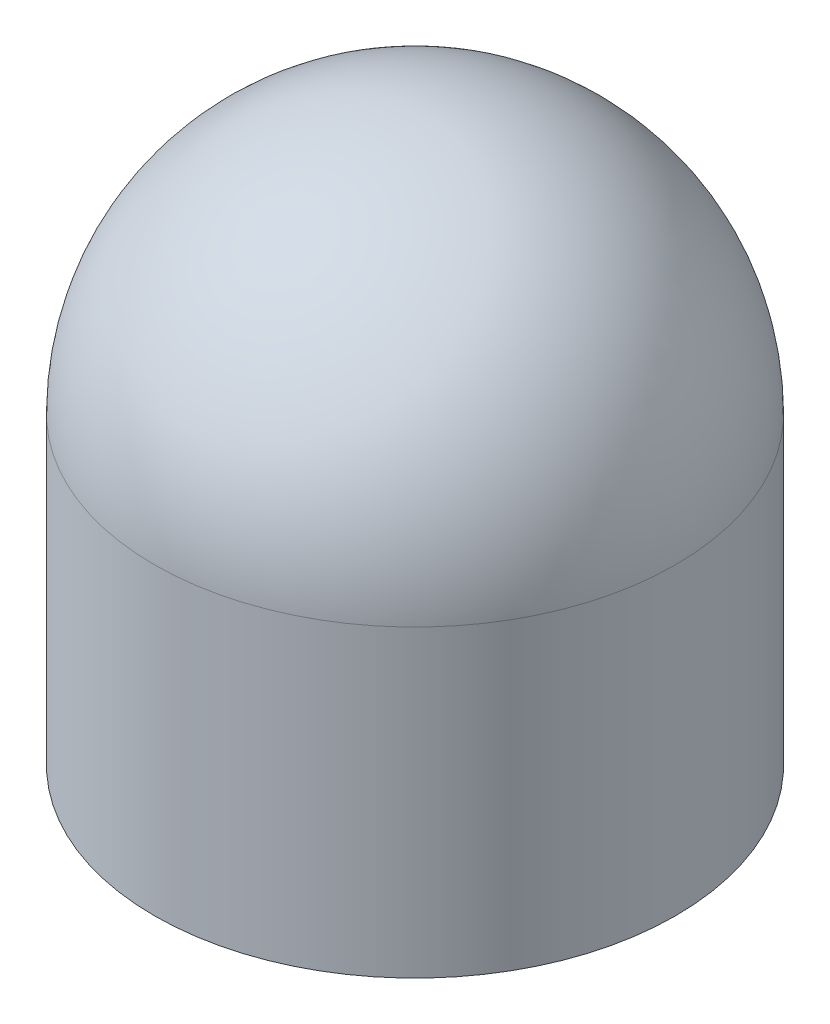
ISO-10303-21;
HEADER;
FILE_DESCRIPTION(('STEP AP214'),'2;1');
FILE_NAME('part.step','',(''),(''),'','','');
FILE_SCHEMA(('AUTOMOTIVE_DESIGN { 1 0 10303 214 1 1 1 1 }'));
ENDSEC;
DATA;
#1=APPLICATION_CONTEXT('core data for automotive mechanical design processes');
#2=APPLICATION_PROTOCOL_DEFINITION('international standard','automotive_design',2000,#1);
#3=PRODUCT_CONTEXT('',#1,'mechanical');
#4=PRODUCT('Part','Part','',(#3));
#5=PRODUCT_RELATED_PRODUCT_CATEGORY('part','',(#4));
#6=PRODUCT_DEFINITION_FORMATION('','',#4);
#7=PRODUCT_DEFINITION_CONTEXT('part definition',#1,'design');
#8=PRODUCT_DEFINITION('design','',#6,#7);
#9=PRODUCT_DEFINITION_SHAPE('','',#8);
#10=(LENGTH_UNIT() NAMED_UNIT(*) SI_UNIT(.MILLI.,.METRE.));
#11=(NAMED_UNIT(*) PLANE_ANGLE_UNIT() SI_UNIT($,.RADIAN.));
#12=(NAMED_UNIT(*) SI_UNIT($,.STERADIAN.) SOLID_ANGLE_UNIT());
#13=UNCERTAINTY_MEASURE_WITH_UNIT(LENGTH_MEASURE(1.E-05),#10,'distance_accuracy_value','');
#14=(GEOMETRIC_REPRESENTATION_CONTEXT(3) GLOBAL_UNCERTAINTY_ASSIGNED_CONTEXT((#13)) GLOBAL_UNIT_ASSIGNED_CONTEXT((#10,
#11,#12)) REPRESENTATION_CONTEXT('',''));
#15=CARTESIAN_POINT('',(0.,0.,0.));
#16=DIRECTION('',(0.,0.,1.));
#17=DIRECTION('',(1.,0.,0.));
#18=AXIS2_PLACEMENT_3D('',#15,#16,#17);
#19=CARTESIAN_POINT('',(0.,1.75,0.));
#20=DIRECTION('',(0.,-1.,0.));
#21=DIRECTION('',(0.,0.,-1.));
#22=AXIS2_PLACEMENT_3D('',#19,#20,#21);
#23=CYLINDRICAL_SURFACE('',#22,1.5);
#24=CARTESIAN_POINT('',(0.,1.75,0.));
#25=DIRECTION('',(0.,1.,0.));
#26=DIRECTION('',(0.,0.,1.));
#27=AXIS2_PLACEMENT_3D('',#24,#25,#26);
#28=CIRCLE('',#27,1.5);
#29=CARTESIAN_POINT('',(0.,1.75,1.5));
#30=VERTEX_POINT('',#29);
#31=EDGE_CURVE('E10',#30,#30,#28,.T.);
#32=ORIENTED_EDGE('',*,*,#31,.F.);
#33=EDGE_LOOP('',(#32));
#34=FACE_BOUND('',#33,.T.);
#35=CARTESIAN_POINT('',(0.,0.,0.));
#36=DIRECTION('',(0.,1.,0.));
#37=DIRECTION('',(0.,0.,1.));
#38=AXIS2_PLACEMENT_3D('',#35,#36,#37);
#39=CIRCLE('',#38,1.5);
#40=CARTESIAN_POINT('',(0.,0.,1.5));
#41=VERTEX_POINT('',#40);
#42=EDGE_CURVE('E40',#41,#41,#39,.T.);
#43=ORIENTED_EDGE('',*,*,#42,.T.);
#44=EDGE_LOOP('',(#43));
#45=FACE_BOUND('',#44,.T.);
#46=ADVANCED_FACE('F33',(#34,#45),#23,.T.);
#47=CARTESIAN_POINT('',(0.,1.75,0.));
#48=DIRECTION('',(0.,0.,1.));
#49=DIRECTION('',(1.,0.,0.));
#50=AXIS2_PLACEMENT_3D('',#47,#48,#49);
#51=SPHERICAL_SURFACE('',#50,1.5);
#52=CARTESIAN_POINT('',(0.,1.75,0.));
#53=DIRECTION('',(0.,1.,0.));
#54=DIRECTION('',(0.,0.,1.));
#55=AXIS2_PLACEMENT_3D('',#52,#53,#54);
#56=SPHERICAL_SURFACE('',#55,1.5);
#57=ORIENTED_EDGE('',*,*,#31,.T.);
#58=EDGE_LOOP('',(#57));
#59=FACE_BOUND('',#58,.T.);
#60=ADVANCED_FACE('F35',(#59),#56,.T.);
#61=CARTESIAN_POINT('',(0.,0.,0.));
#62=DIRECTION('',(0.,1.,0.));
#63=DIRECTION('',(0.,0.,1.));
#64=AXIS2_PLACEMENT_3D('',#61,#62,#63);
#65=PLANE('',#64);
#66=ORIENTED_EDGE('',*,*,#42,.F.);
#67=EDGE_LOOP('',(#66));
#68=FACE_BOUND('',#67,.T.);
#69=ADVANCED_FACE('F47',(#68),#65,.F.);
#70=CLOSED_SHELL('',(#46,#60,#69));
#71=MANIFOLD_SOLID_BREP('B2',#70);
#72=ADVANCED_BREP_SHAPE_REPRESENTATION('',(#18,#71),#14);
#73=SHAPE_DEFINITION_REPRESENTATION(#9,#72);
ENDSEC;
END-ISO-10303-21;
